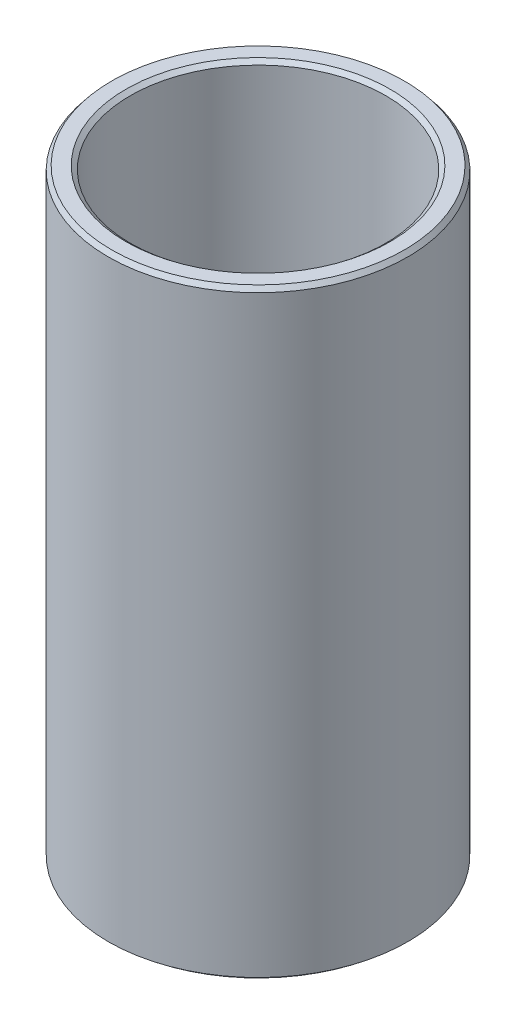
ISO-10303-21;
HEADER;
FILE_DESCRIPTION(('STEP AP214'),'2;1');
FILE_NAME('part.step','',(''),(''),'','','');
FILE_SCHEMA(('AUTOMOTIVE_DESIGN { 1 0 10303 214 1 1 1 1 }'));
ENDSEC;
DATA;
#1=APPLICATION_CONTEXT('core data for automotive mechanical design processes');
#2=APPLICATION_PROTOCOL_DEFINITION('international standard','automotive_design',2000,#1);
#3=PRODUCT_CONTEXT('',#1,'mechanical');
#4=PRODUCT('Part','Part','',(#3));
#5=PRODUCT_RELATED_PRODUCT_CATEGORY('part','',(#4));
#6=PRODUCT_DEFINITION_FORMATION('','',#4);
#7=PRODUCT_DEFINITION_CONTEXT('part definition',#1,'design');
#8=PRODUCT_DEFINITION('design','',#6,#7);
#9=PRODUCT_DEFINITION_SHAPE('','',#8);
#10=(LENGTH_UNIT() NAMED_UNIT(*) SI_UNIT(.MILLI.,.METRE.));
#11=(NAMED_UNIT(*) PLANE_ANGLE_UNIT() SI_UNIT($,.RADIAN.));
#12=(NAMED_UNIT(*) SI_UNIT($,.STERADIAN.) SOLID_ANGLE_UNIT());
#13=UNCERTAINTY_MEASURE_WITH_UNIT(LENGTH_MEASURE(1.E-05),#10,'distance_accuracy_value','');
#14=(GEOMETRIC_REPRESENTATION_CONTEXT(3) GLOBAL_UNCERTAINTY_ASSIGNED_CONTEXT((#13)) GLOBAL_UNIT_ASSIGNED_CONTEXT((#10,
#11,#12)) REPRESENTATION_CONTEXT('',''));
#15=CARTESIAN_POINT('',(0.,0.,0.));
#16=DIRECTION('',(0.,0.,1.));
#17=DIRECTION('',(1.,0.,0.));
#18=AXIS2_PLACEMENT_3D('',#15,#16,#17);
#19=CARTESIAN_POINT('',(0.,110.297400037924,0.));
#20=DIRECTION('',(0.,-1.,0.));
#21=DIRECTION('',(0.,0.,-1.));
#22=AXIS2_PLACEMENT_3D('',#19,#20,#21);
#23=CYLINDRICAL_SURFACE('',#22,27.5);
#24=CARTESIAN_POINT('',(0.,0.636816709164781,0.));
#25=DIRECTION('',(0.,1.,0.));
#26=DIRECTION('',(0.,0.,1.));
#27=AXIS2_PLACEMENT_3D('',#24,#25,#26);
#28=CIRCLE('',#27,27.5);
#29=CARTESIAN_POINT('',(0.,0.636816709164781,27.5));
#30=VERTEX_POINT('',#29);
#31=EDGE_CURVE('E10',#30,#30,#28,.T.);
#32=ORIENTED_EDGE('',*,*,#31,.T.);
#33=EDGE_LOOP('',(#32));
#34=FACE_BOUND('',#33,.T.);
#35=CARTESIAN_POINT('',(0.,109.502046396207,0.));
#36=DIRECTION('',(0.,1.,0.));
#37=DIRECTION('',(0.,0.,1.));
#38=AXIS2_PLACEMENT_3D('',#35,#36,#37);
#39=CIRCLE('',#38,27.5);
#40=CARTESIAN_POINT('',(0.,109.502046396207,27.5));
#41=VERTEX_POINT('',#40);
#42=EDGE_CURVE('E50',#41,#41,#39,.F.);
#43=ORIENTED_EDGE('',*,*,#42,.T.);
#44=EDGE_LOOP('',(#43));
#45=FACE_BOUND('',#44,.T.);
#46=ADVANCED_FACE('F39',(#34,#45),#23,.T.);
#47=CARTESIAN_POINT('',(0.,110.297400037924,0.));
#48=DIRECTION('',(0.,1.,0.));
#49=DIRECTION('',(0.,0.,1.));
#50=AXIS2_PLACEMENT_3D('',#47,#48,#49);
#51=PLANE('',#50);
#52=CARTESIAN_POINT('',(0.,110.297400037924,0.));
#53=DIRECTION('',(0.,1.,0.));
#54=DIRECTION('',(0.,0.,1.));
#55=AXIS2_PLACEMENT_3D('',#52,#53,#54);
#56=CIRCLE('',#55,24.2553298132363);
#57=CARTESIAN_POINT('',(0.,110.297400037924,24.2553298132363));
#58=VERTEX_POINT('',#57);
#59=EDGE_CURVE('E58',#58,#58,#56,.F.);
#60=ORIENTED_EDGE('',*,*,#59,.T.);
#61=EDGE_LOOP('',(#60));
#62=FACE_BOUND('',#61,.T.);
#63=CARTESIAN_POINT('',(0.,110.297400037924,0.));
#64=DIRECTION('',(0.,1.,0.));
#65=DIRECTION('',(0.,0.,1.));
#66=AXIS2_PLACEMENT_3D('',#63,#64,#65);
#67=CIRCLE('',#66,26.8631832908352);
#68=CARTESIAN_POINT('',(0.,110.297400037924,26.8631832908352));
#69=VERTEX_POINT('',#68);
#70=EDGE_CURVE('E61',#69,#69,#67,.T.);
#71=ORIENTED_EDGE('',*,*,#70,.T.);
#72=EDGE_LOOP('',(#71));
#73=FACE_BOUND('',#72,.T.);
#74=ADVANCED_FACE('F88',(#62,#73),#51,.T.);
#75=CARTESIAN_POINT('',(0.,0.,0.));
#76=DIRECTION('',(0.,1.,0.));
#77=DIRECTION('',(0.,0.,1.));
#78=AXIS2_PLACEMENT_3D('',#75,#76,#77);
#79=PLANE('',#78);
#80=CARTESIAN_POINT('',(0.,0.,0.));
#81=DIRECTION('',(0.,1.,0.));
#82=DIRECTION('',(0.,0.,1.));
#83=AXIS2_PLACEMENT_3D('',#80,#81,#82);
#84=CIRCLE('',#83,24.0967928806842);
#85=CARTESIAN_POINT('',(0.,0.,24.0967928806842));
#86=VERTEX_POINT('',#85);
#87=EDGE_CURVE('E51',#86,#86,#84,.T.);
#88=ORIENTED_EDGE('',*,*,#87,.T.);
#89=EDGE_LOOP('',(#88));
#90=FACE_BOUND('',#89,.T.);
#91=CARTESIAN_POINT('',(0.,0.,0.));
#92=DIRECTION('',(0.,1.,0.));
#93=DIRECTION('',(0.,0.,1.));
#94=AXIS2_PLACEMENT_3D('',#91,#92,#93);
#95=CIRCLE('',#94,26.7046463582831);
#96=CARTESIAN_POINT('',(0.,0.,26.7046463582831));
#97=VERTEX_POINT('',#96);
#98=EDGE_CURVE('E54',#97,#97,#95,.F.);
#99=ORIENTED_EDGE('',*,*,#98,.T.);
#100=EDGE_LOOP('',(#99));
#101=FACE_BOUND('',#100,.T.);
#102=ADVANCED_FACE('F83',(#90,#101),#79,.F.);
#103=CARTESIAN_POINT('',(0.,110.297400037924,0.));
#104=DIRECTION('',(0.,-1.,0.));
#105=DIRECTION('',(0.,0.,-1.));
#106=AXIS2_PLACEMENT_3D('',#103,#104,#105);
#107=CYLINDRICAL_SURFACE('',#106,23.4599761715194);
#108=CARTESIAN_POINT('',(0.,109.660583328759,0.));
#109=DIRECTION('',(0.,1.,0.));
#110=DIRECTION('',(0.,0.,1.));
#111=AXIS2_PLACEMENT_3D('',#108,#109,#110);
#112=CIRCLE('',#111,23.4599761715194);
#113=CARTESIAN_POINT('',(0.,109.660583328759,23.4599761715194));
#114=VERTEX_POINT('',#113);
#115=EDGE_CURVE('E67',#114,#114,#112,.T.);
#116=ORIENTED_EDGE('',*,*,#115,.T.);
#117=EDGE_LOOP('',(#116));
#118=FACE_BOUND('',#117,.T.);
#119=CARTESIAN_POINT('',(0.,0.795353641716887,0.));
#120=DIRECTION('',(0.,1.,0.));
#121=DIRECTION('',(0.,0.,1.));
#122=AXIS2_PLACEMENT_3D('',#119,#120,#121);
#123=CIRCLE('',#122,23.4599761715194);
#124=CARTESIAN_POINT('',(0.,0.795353641716887,23.4599761715194));
#125=VERTEX_POINT('',#124);
#126=EDGE_CURVE('E69',#125,#125,#123,.F.);
#127=ORIENTED_EDGE('',*,*,#126,.T.);
#128=EDGE_LOOP('',(#127));
#129=FACE_BOUND('',#128,.T.);
#130=ADVANCED_FACE('F71',(#118,#129),#107,.F.);
#131=CARTESIAN_POINT('',(0.,109.660583328759,0.));
#132=DIRECTION('',(0.,1.,0.));
#133=DIRECTION('',(0.,0.,1.));
#134=AXIS2_PLACEMENT_3D('',#131,#132,#133);
#135=CONICAL_SURFACE('',#134,23.4599761715194,0.895646285173663);
#136=ORIENTED_EDGE('',*,*,#59,.F.);
#137=EDGE_LOOP('',(#136));
#138=FACE_BOUND('',#137,.T.);
#139=ORIENTED_EDGE('',*,*,#115,.F.);
#140=EDGE_LOOP('',(#139));
#141=FACE_BOUND('',#140,.T.);
#142=ADVANCED_FACE('F77',(#138,#141),#135,.F.);
#143=CARTESIAN_POINT('',(0.,0.,0.));
#144=DIRECTION('',(0.,-1.,0.));
#145=DIRECTION('',(0.,0.,-1.));
#146=AXIS2_PLACEMENT_3D('',#143,#144,#145);
#147=CONICAL_SURFACE('',#146,24.0967928806842,0.675150041621231);
#148=ORIENTED_EDGE('',*,*,#126,.F.);
#149=EDGE_LOOP('',(#148));
#150=FACE_BOUND('',#149,.T.);
#151=ORIENTED_EDGE('',*,*,#87,.F.);
#152=EDGE_LOOP('',(#151));
#153=FACE_BOUND('',#152,.T.);
#154=ADVANCED_FACE('F73',(#150,#153),#147,.F.);
#155=CARTESIAN_POINT('',(0.,0.636816709164781,0.));
#156=DIRECTION('',(0.,1.,0.));
#157=DIRECTION('',(0.,0.,1.));
#158=AXIS2_PLACEMENT_3D('',#155,#156,#157);
#159=CONICAL_SURFACE('',#158,27.5,0.895646285173665);
#160=CARTESIAN_POINT('',(0.,0.,26.7046463582831));
#161=CARTESIAN_POINT('',(0.,0.00663350738713305,26.712931292051));
#162=CARTESIAN_POINT('',(0.,0.0132670147742662,26.7212162258189));
#163=CARTESIAN_POINT('',(0.,0.0265340295485324,26.7377860933546));
#164=CARTESIAN_POINT('',(0.,0.0331675369356655,26.7460710271225));
#165=CARTESIAN_POINT('',(0.,0.0464345517099319,26.7626408946583));
#166=CARTESIAN_POINT('',(0.,0.0530680590970651,26.7709258284262));
#167=CARTESIAN_POINT('',(0.,0.0663350738713311,26.787495695962));
#168=CARTESIAN_POINT('',(0.,0.072968581258464,26.7957806297298));
#169=CARTESIAN_POINT('',(0.,0.0862355960327304,26.8123504972656));
#170=CARTESIAN_POINT('',(0.,0.092869103419864,26.8206354310335));
#171=CARTESIAN_POINT('',(0.,0.10613611819413,26.8372052985693));
#172=CARTESIAN_POINT('',(0.,0.112769625581263,26.8454902323371));
#173=CARTESIAN_POINT('',(0.,0.126036640355529,26.8620600998729));
#174=CARTESIAN_POINT('',(0.,0.132670147742663,26.8703450336408));
#175=CARTESIAN_POINT('',(0.,0.145937162516929,26.8869149011766));
#176=CARTESIAN_POINT('',(0.,0.152570669904062,26.8951998349444));
#177=CARTESIAN_POINT('',(0.,0.165837684678328,26.9117697024802));
#178=CARTESIAN_POINT('',(0.,0.172471192065461,26.9200546362481));
#179=CARTESIAN_POINT('',(0.,0.185738206839728,26.9366245037839));
#180=CARTESIAN_POINT('',(0.,0.192371714226861,26.9449094375518));
#181=CARTESIAN_POINT('',(0.,0.205638729001127,26.9614793050875));
#182=CARTESIAN_POINT('',(0.,0.21227223638826,26.9697642388554));
#183=CARTESIAN_POINT('',(0.,0.225539251162527,26.9863341063912));
#184=CARTESIAN_POINT('',(0.,0.23217275854966,26.9946190401591));
#185=CARTESIAN_POINT('',(0.,0.245439773323926,27.0111889076948));
#186=CARTESIAN_POINT('',(0.,0.252073280711059,27.0194738414627));
#187=CARTESIAN_POINT('',(0.,0.265340295485325,27.0360437089985));
#188=CARTESIAN_POINT('',(0.,0.271973802872459,27.0443286427664));
#189=CARTESIAN_POINT('',(0.,0.285240817646725,27.0608985103021));
#190=CARTESIAN_POINT('',(0.,0.291874325033857,27.06918344407));
#191=CARTESIAN_POINT('',(0.,0.305141339808124,27.0857533116058));
#192=CARTESIAN_POINT('',(0.,0.311774847195257,27.0940382453737));
#193=CARTESIAN_POINT('',(0.,0.325041861969524,27.1106081129094));
#194=CARTESIAN_POINT('',(0.,0.331675369356657,27.1188930466773));
#195=CARTESIAN_POINT('',(0.,0.344942384130923,27.1354629142131));
#196=CARTESIAN_POINT('',(0.,0.351575891518056,27.143747847981));
#197=CARTESIAN_POINT('',(0.,0.364842906292322,27.1603177155167));
#198=CARTESIAN_POINT('',(0.,0.371476413679455,27.1686026492846));
#199=CARTESIAN_POINT('',(0.,0.384743428453722,27.1851725168204));
#200=CARTESIAN_POINT('',(0.,0.391376935840855,27.1934574505883));
#201=CARTESIAN_POINT('',(0.,0.404643950615121,27.210027318124));
#202=CARTESIAN_POINT('',(0.,0.411277458002254,27.2183122518919));
#203=CARTESIAN_POINT('',(0.,0.424544472776521,27.2348821194277));
#204=CARTESIAN_POINT('',(0.,0.431177980163654,27.2431670531956));
#205=CARTESIAN_POINT('',(0.,0.44444499493792,27.2597369207314));
#206=CARTESIAN_POINT('',(0.,0.451078502325053,27.2680218544992));
#207=CARTESIAN_POINT('',(0.,0.464345517099319,27.284591722035));
#208=CARTESIAN_POINT('',(0.,0.470979024486452,27.2928766558029));
#209=CARTESIAN_POINT('',(0.,0.484246039260719,27.3094465233387));
#210=CARTESIAN_POINT('',(0.,0.490879546647852,27.3177314571066));
#211=CARTESIAN_POINT('',(0.,0.504146561422118,27.3343013246423));
#212=CARTESIAN_POINT('',(0.,0.510780068809251,27.3425862584102));
#213=CARTESIAN_POINT('',(0.,0.524047083583517,27.359156125946));
#214=CARTESIAN_POINT('',(0.,0.530680590970651,27.3674410597139));
#215=CARTESIAN_POINT('',(0.,0.543947605744917,27.3840109272496));
#216=CARTESIAN_POINT('',(0.,0.55058111313205,27.3922958610175));
#217=CARTESIAN_POINT('',(0.,0.563848127906316,27.4088657285533));
#218=CARTESIAN_POINT('',(0.,0.570481635293449,27.4171506623212));
#219=CARTESIAN_POINT('',(0.,0.583748650067716,27.4337205298569));
#220=CARTESIAN_POINT('',(0.,0.590382157454849,27.4420054636248));
#221=CARTESIAN_POINT('',(0.,0.603649172229115,27.4585753311606));
#222=CARTESIAN_POINT('',(0.,0.610282679616248,27.4668602649285));
#223=CARTESIAN_POINT('',(0.,0.623549694390515,27.4834301324642));
#224=CARTESIAN_POINT('',(0.,0.630183201777648,27.4917150662321));
#225=CARTESIAN_POINT('',(0.,0.636816709164781,27.5));
#226=B_SPLINE_CURVE_WITH_KNOTS('',3,(#160,#161,#162,#163,#164,#165,#166,#167,#168,#169,#170,
#171,#172,#173,#174,#175,#176,#177,#178,#179,#180,#181,#182,#183,#184,#185,#186,#187,#188,#189,
#190,#191,#192,#193,#194,#195,#196,#197,#198,#199,#200,#201,#202,#203,#204,#205,#206,#207,#208,
#209,#210,#211,#212,#213,#214,#215,#216,#217,#218,#219,#220,#221,#222,#223,#224,#225),
.UNSPECIFIED.,.F.,.F.,(4,2,2,2,2,2,2,2,2,2,2,2,2,2,2,2,2,2,2,2,2,2,2,2,2,2,2,2,2,2,2,2,4),(0.,
0.0318400994053163,0.0636801988106327,0.095520298215949,0.127360397621265,0.159200497026579,
0.191040596431895,0.222880695837212,0.254720795242528,0.286560894647844,0.318400994053161,
0.350241093458477,0.382081192863793,0.41392129226911,0.445761391674426,0.477601491079742,
0.509441590485056,0.541281689890372,0.573121789295689,0.604961888701005,0.636801988106321,
0.668642087511638,0.700482186916954,0.73232228632227,0.764162385727587,0.796002485132903,
0.827842584538219,0.859682683943533,0.891522783348849,0.923362882754166,0.955202982159482,
0.987043081564798,1.01888318097011),.UNSPECIFIED.);
#227=EDGE_CURVE('BSEAM76',#97,#30,#226,.T.);
#228=ORIENTED_EDGE('',*,*,#98,.F.);
#229=ORIENTED_EDGE('',*,*,#31,.F.);
#230=ORIENTED_EDGE('',*,*,#227,.T.);
#231=ORIENTED_EDGE('',*,*,#227,.F.);
#232=EDGE_LOOP('',(#228,#230,#229,#231));
#233=FACE_BOUND('',#232,.T.);
#234=ADVANCED_FACE('F76',(#233),#159,.T.);
#235=CARTESIAN_POINT('',(0.,110.297400037924,0.));
#236=DIRECTION('',(0.,-1.,0.));
#237=DIRECTION('',(0.,0.,-1.));
#238=AXIS2_PLACEMENT_3D('',#235,#236,#237);
#239=CONICAL_SURFACE('',#238,26.8631832908352,0.675150041621226);
#240=ORIENTED_EDGE('',*,*,#42,.F.);
#241=EDGE_LOOP('',(#240));
#242=FACE_BOUND('',#241,.T.);
#243=ORIENTED_EDGE('',*,*,#70,.F.);
#244=EDGE_LOOP('',(#243));
#245=FACE_BOUND('',#244,.T.);
#246=ADVANCED_FACE('F45',(#242,#245),#239,.T.);
#247=CLOSED_SHELL('',(#46,#74,#102,#130,#142,#154,#234,#246));
#248=MANIFOLD_SOLID_BREP('B2',#247);
#249=ADVANCED_BREP_SHAPE_REPRESENTATION('',(#18,#248),#14);
#250=SHAPE_DEFINITION_REPRESENTATION(#9,#249);
ENDSEC;
END-ISO-10303-21;
